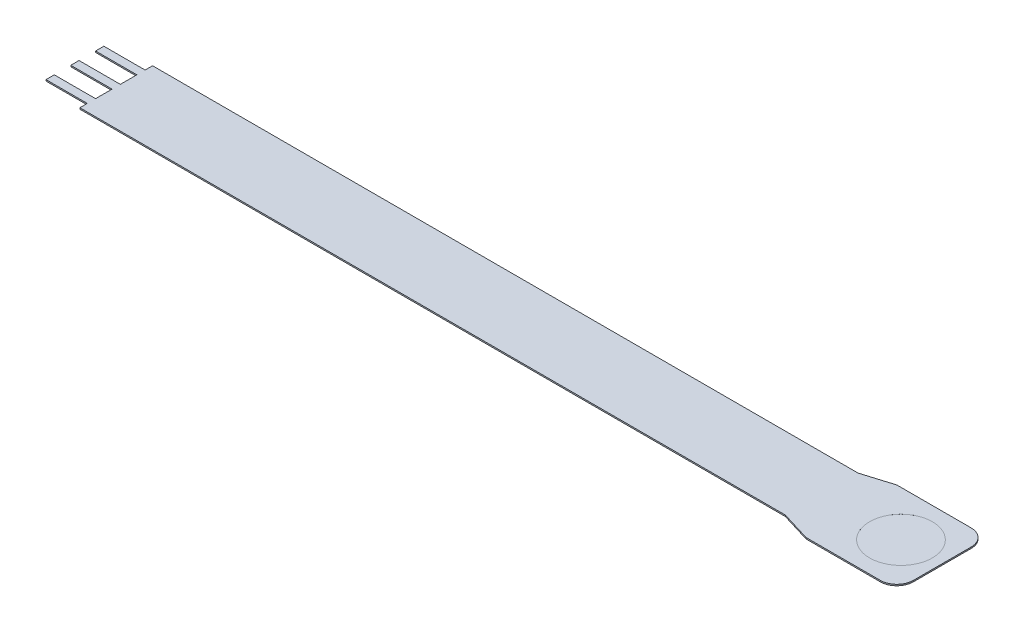
ISO-10303-21;
HEADER;
FILE_DESCRIPTION(('STEP AP214'),'2;1');
FILE_NAME('part.step','',(''),(''),'','','');
FILE_SCHEMA(('AUTOMOTIVE_DESIGN { 1 0 10303 214 1 1 1 1 }'));
ENDSEC;
DATA;
#1=APPLICATION_CONTEXT('core data for automotive mechanical design processes');
#2=APPLICATION_PROTOCOL_DEFINITION('international standard','automotive_design',2000,#1);
#3=PRODUCT_CONTEXT('',#1,'mechanical');
#4=PRODUCT('Part','Part','',(#3));
#5=PRODUCT_RELATED_PRODUCT_CATEGORY('part','',(#4));
#6=PRODUCT_DEFINITION_FORMATION('','',#4);
#7=PRODUCT_DEFINITION_CONTEXT('part definition',#1,'design');
#8=PRODUCT_DEFINITION('design','',#6,#7);
#9=PRODUCT_DEFINITION_SHAPE('','',#8);
#10=(LENGTH_UNIT() NAMED_UNIT(*) SI_UNIT(.MILLI.,.METRE.));
#11=(NAMED_UNIT(*) PLANE_ANGLE_UNIT() SI_UNIT($,.RADIAN.));
#12=(NAMED_UNIT(*) SI_UNIT($,.STERADIAN.) SOLID_ANGLE_UNIT());
#13=UNCERTAINTY_MEASURE_WITH_UNIT(LENGTH_MEASURE(1.E-05),#10,'distance_accuracy_value','');
#14=(GEOMETRIC_REPRESENTATION_CONTEXT(3) GLOBAL_UNCERTAINTY_ASSIGNED_CONTEXT((#13)) GLOBAL_UNIT_ASSIGNED_CONTEXT((#10,
#11,#12)) REPRESENTATION_CONTEXT('',''));
#15=CARTESIAN_POINT('',(0.,0.,0.));
#16=DIRECTION('',(0.,0.,1.));
#17=DIRECTION('',(1.,0.,0.));
#18=AXIS2_PLACEMENT_3D('',#15,#16,#17);
#19=CARTESIAN_POINT('',(-12.1920000000001,0.2032,5.58799999999999));
#20=DIRECTION('',(0.29221853559902,0.,-0.956351571051339));
#21=DIRECTION('',(-0.956351571051339,0.,-0.29221853559902));
#22=AXIS2_PLACEMENT_3D('',#19,#20,#21);
#23=PLANE('',#22);
#24=DIRECTION('',(0.956351571051339,0.,0.29221853559902));
#25=VECTOR('',#24,1.);
#26=CARTESIAN_POINT('',(-12.1920000000001,0.,5.58799999999999));
#27=LINE('',#26,#25);
#28=CARTESIAN_POINT('',(-12.1920000000001,0.,5.58799999999999));
#29=VERTEX_POINT('',#28);
#30=CARTESIAN_POINT('',(-7.62000000000006,0.,6.98499999999999));
#31=VERTEX_POINT('',#30);
#32=EDGE_CURVE('E214',#29,#31,#27,.T.);
#33=ORIENTED_EDGE('',*,*,#32,.T.);
#34=DIRECTION('',(0.,-1.,0.));
#35=VECTOR('',#34,1.);
#36=CARTESIAN_POINT('',(-7.62000000000006,0.2032,6.98499999999999));
#37=LINE('',#36,#35);
#38=CARTESIAN_POINT('',(-7.62000000000006,0.2032,6.98499999999999));
#39=VERTEX_POINT('',#38);
#40=EDGE_CURVE('E197',#39,#31,#37,.T.);
#41=ORIENTED_EDGE('',*,*,#40,.F.);
#42=DIRECTION('',(0.956351571051339,0.,0.29221853559902));
#43=VECTOR('',#42,1.);
#44=CARTESIAN_POINT('',(-12.1920000000001,0.2032,5.58799999999999));
#45=LINE('',#44,#43);
#46=CARTESIAN_POINT('',(-12.1920000000001,0.2032,5.58799999999999));
#47=VERTEX_POINT('',#46);
#48=EDGE_CURVE('E202',#47,#39,#45,.T.);
#49=ORIENTED_EDGE('',*,*,#48,.F.);
#50=DIRECTION('',(0.,-1.,0.));
#51=VECTOR('',#50,1.);
#52=CARTESIAN_POINT('',(-12.1920000000001,0.2032,5.58799999999999));
#53=LINE('',#52,#51);
#54=EDGE_CURVE('E294',#47,#29,#53,.T.);
#55=ORIENTED_EDGE('',*,*,#54,.T.);
#56=EDGE_LOOP('',(#33,#41,#49,#55));
#57=FACE_BOUND('',#56,.T.);
#58=ADVANCED_FACE('F45',(#57),#23,.F.);
#59=CARTESIAN_POINT('',(-7.62000000000006,0.2032,6.98499999999999));
#60=DIRECTION('',(0.,0.,-1.));
#61=DIRECTION('',(-1.,0.,0.));
#62=AXIS2_PLACEMENT_3D('',#59,#60,#61);
#63=PLANE('',#62);
#64=DIRECTION('',(1.,0.,0.));
#65=VECTOR('',#64,1.);
#66=CARTESIAN_POINT('',(-7.62000000000006,0.,6.98499999999999));
#67=LINE('',#66,#65);
#68=CARTESIAN_POINT('',(3.81,0.,6.98500000000001));
#69=VERTEX_POINT('',#68);
#70=EDGE_CURVE('E255',#31,#69,#67,.T.);
#71=ORIENTED_EDGE('',*,*,#70,.T.);
#72=DIRECTION('',(0.,-1.,0.));
#73=VECTOR('',#72,1.);
#74=CARTESIAN_POINT('',(3.81,0.2032,6.98500000000001));
#75=LINE('',#74,#73);
#76=CARTESIAN_POINT('',(3.81,0.2032,6.98500000000001));
#77=VERTEX_POINT('',#76);
#78=EDGE_CURVE('E11',#69,#77,#75,.F.);
#79=ORIENTED_EDGE('',*,*,#78,.T.);
#80=DIRECTION('',(1.,0.,0.));
#81=VECTOR('',#80,1.);
#82=CARTESIAN_POINT('',(-7.62000000000006,0.2032,6.98499999999999));
#83=LINE('',#82,#81);
#84=EDGE_CURVE('E193',#39,#77,#83,.T.);
#85=ORIENTED_EDGE('',*,*,#84,.F.);
#86=ORIENTED_EDGE('',*,*,#40,.T.);
#87=EDGE_LOOP('',(#71,#79,#85,#86));
#88=FACE_BOUND('',#87,.T.);
#89=ADVANCED_FACE('F195',(#88),#63,.F.);
#90=CARTESIAN_POINT('',(6.35,0.2032,-6.98499999999999));
#91=DIRECTION('',(-1.,0.,0.));
#92=DIRECTION('',(0.,0.,1.));
#93=AXIS2_PLACEMENT_3D('',#90,#91,#92);
#94=PLANE('',#93);
#95=DIRECTION('',(0.,0.,-1.));
#96=VECTOR('',#95,1.);
#97=CARTESIAN_POINT('',(6.35,0.,-6.98499999999999));
#98=LINE('',#97,#96);
#99=CARTESIAN_POINT('',(6.35,0.,4.44500000000001));
#100=VERTEX_POINT('',#99);
#101=CARTESIAN_POINT('',(6.35,0.,-4.44499999999999));
#102=VERTEX_POINT('',#101);
#103=EDGE_CURVE('E250',#100,#102,#98,.T.);
#104=ORIENTED_EDGE('',*,*,#103,.T.);
#105=DIRECTION('',(0.,-1.,0.));
#106=VECTOR('',#105,1.);
#107=CARTESIAN_POINT('',(6.35,0.2032,-4.44499999999999));
#108=LINE('',#107,#106);
#109=CARTESIAN_POINT('',(6.35,0.2032,-4.44499999999999));
#110=VERTEX_POINT('',#109);
#111=EDGE_CURVE('E66',#102,#110,#108,.F.);
#112=ORIENTED_EDGE('',*,*,#111,.T.);
#113=DIRECTION('',(0.,0.,-1.));
#114=VECTOR('',#113,1.);
#115=CARTESIAN_POINT('',(6.35,0.2032,-6.98499999999999));
#116=LINE('',#115,#114);
#117=CARTESIAN_POINT('',(6.35,0.2032,4.44500000000001));
#118=VERTEX_POINT('',#117);
#119=EDGE_CURVE('E201',#118,#110,#116,.T.);
#120=ORIENTED_EDGE('',*,*,#119,.F.);
#121=DIRECTION('',(0.,-1.,0.));
#122=VECTOR('',#121,1.);
#123=CARTESIAN_POINT('',(6.35,0.2032,4.44500000000001));
#124=LINE('',#123,#122);
#125=EDGE_CURVE('E229',#118,#100,#124,.T.);
#126=ORIENTED_EDGE('',*,*,#125,.T.);
#127=EDGE_LOOP('',(#104,#112,#120,#126));
#128=FACE_BOUND('',#127,.T.);
#129=ADVANCED_FACE('F253',(#128),#94,.F.);
#130=CARTESIAN_POINT('',(-7.62000000000001,0.2032,-6.98499999999999));
#131=DIRECTION('',(0.,0.,1.));
#132=DIRECTION('',(1.,0.,0.));
#133=AXIS2_PLACEMENT_3D('',#130,#131,#132);
#134=PLANE('',#133);
#135=DIRECTION('',(-1.,0.,0.));
#136=VECTOR('',#135,1.);
#137=CARTESIAN_POINT('',(-7.62000000000001,0.2032,-6.98499999999999));
#138=LINE('',#137,#136);
#139=CARTESIAN_POINT('',(3.81,0.2032,-6.98499999999999));
#140=VERTEX_POINT('',#139);
#141=CARTESIAN_POINT('',(-7.62000000000001,0.2032,-6.98499999999999));
#142=VERTEX_POINT('',#141);
#143=EDGE_CURVE('E236',#140,#142,#138,.T.);
#144=ORIENTED_EDGE('',*,*,#143,.F.);
#145=DIRECTION('',(0.,-1.,0.));
#146=VECTOR('',#145,1.);
#147=CARTESIAN_POINT('',(3.81,0.2032,-6.98499999999999));
#148=LINE('',#147,#146);
#149=CARTESIAN_POINT('',(3.81,0.,-6.98499999999999));
#150=VERTEX_POINT('',#149);
#151=EDGE_CURVE('E215',#140,#150,#148,.T.);
#152=ORIENTED_EDGE('',*,*,#151,.T.);
#153=DIRECTION('',(-1.,0.,0.));
#154=VECTOR('',#153,1.);
#155=CARTESIAN_POINT('',(-7.62000000000001,0.,-6.98499999999999));
#156=LINE('',#155,#154);
#157=CARTESIAN_POINT('',(-7.62000000000001,0.,-6.98499999999999));
#158=VERTEX_POINT('',#157);
#159=EDGE_CURVE('E252',#150,#158,#156,.T.);
#160=ORIENTED_EDGE('',*,*,#159,.T.);
#161=DIRECTION('',(0.,-1.,0.));
#162=VECTOR('',#161,1.);
#163=CARTESIAN_POINT('',(-7.62000000000001,0.2032,-6.98499999999999));
#164=LINE('',#163,#162);
#165=EDGE_CURVE('E216',#142,#158,#164,.T.);
#166=ORIENTED_EDGE('',*,*,#165,.F.);
#167=EDGE_LOOP('',(#144,#152,#160,#166));
#168=FACE_BOUND('',#167,.T.);
#169=ADVANCED_FACE('F241',(#168),#134,.F.);
#170=CARTESIAN_POINT('',(-12.192,0.2032,-5.58799999999999));
#171=DIRECTION('',(0.292218535599021,0.,0.956351571051339));
#172=DIRECTION('',(0.956351571051339,0.,-0.292218535599021));
#173=AXIS2_PLACEMENT_3D('',#170,#171,#172);
#174=PLANE('',#173);
#175=DIRECTION('',(-0.956351571051339,0.,0.292218535599021));
#176=VECTOR('',#175,1.);
#177=CARTESIAN_POINT('',(-12.192,0.,-5.58799999999999));
#178=LINE('',#177,#176);
#179=CARTESIAN_POINT('',(-12.192,0.,-5.58799999999999));
#180=VERTEX_POINT('',#179);
#181=EDGE_CURVE('E257',#158,#180,#178,.T.);
#182=ORIENTED_EDGE('',*,*,#181,.T.);
#183=DIRECTION('',(0.,-1.,0.));
#184=VECTOR('',#183,1.);
#185=CARTESIAN_POINT('',(-12.192,0.2032,-5.58799999999999));
#186=LINE('',#185,#184);
#187=CARTESIAN_POINT('',(-12.192,0.2032,-5.58799999999999));
#188=VERTEX_POINT('',#187);
#189=EDGE_CURVE('E222',#188,#180,#186,.T.);
#190=ORIENTED_EDGE('',*,*,#189,.F.);
#191=DIRECTION('',(-0.956351571051339,0.,0.292218535599021));
#192=VECTOR('',#191,1.);
#193=CARTESIAN_POINT('',(-12.192,0.2032,-5.58799999999999));
#194=LINE('',#193,#192);
#195=EDGE_CURVE('E244',#142,#188,#194,.T.);
#196=ORIENTED_EDGE('',*,*,#195,.F.);
#197=ORIENTED_EDGE('',*,*,#165,.T.);
#198=EDGE_LOOP('',(#182,#190,#196,#197));
#199=FACE_BOUND('',#198,.T.);
#200=ADVANCED_FACE('F345',(#199),#174,.F.);
#201=CARTESIAN_POINT('',(-120.65,0.2032,-5.58799999999999));
#202=DIRECTION('',(0.,0.,1.));
#203=DIRECTION('',(1.,0.,0.));
#204=AXIS2_PLACEMENT_3D('',#201,#202,#203);
#205=PLANE('',#204);
#206=DIRECTION('',(-1.,0.,0.));
#207=VECTOR('',#206,1.);
#208=CARTESIAN_POINT('',(-120.65,0.,-5.58799999999999));
#209=LINE('',#208,#207);
#210=CARTESIAN_POINT('',(-120.65,0.,-5.58799999999999));
#211=VERTEX_POINT('',#210);
#212=EDGE_CURVE('E264',#180,#211,#209,.T.);
#213=ORIENTED_EDGE('',*,*,#212,.T.);
#214=DIRECTION('',(0.,-1.,0.));
#215=VECTOR('',#214,1.);
#216=CARTESIAN_POINT('',(-120.65,0.2032,-5.58799999999999));
#217=LINE('',#216,#215);
#218=CARTESIAN_POINT('',(-120.65,0.2032,-5.58799999999999));
#219=VERTEX_POINT('',#218);
#220=EDGE_CURVE('E335',#219,#211,#217,.T.);
#221=ORIENTED_EDGE('',*,*,#220,.F.);
#222=DIRECTION('',(-1.,0.,0.));
#223=VECTOR('',#222,1.);
#224=CARTESIAN_POINT('',(-108.74870511297,0.2032,-5.58799999999999));
#225=LINE('',#224,#223);
#226=EDGE_CURVE('E343',#188,#219,#225,.T.);
#227=ORIENTED_EDGE('',*,*,#226,.F.);
#228=ORIENTED_EDGE('',*,*,#189,.T.);
#229=EDGE_LOOP('',(#213,#221,#227,#228));
#230=FACE_BOUND('',#229,.T.);
#231=ADVANCED_FACE('F341',(#230),#205,.F.);
#232=CARTESIAN_POINT('',(-120.65,0.2032,-5.58799999999999));
#233=DIRECTION('',(1.,0.,0.));
#234=DIRECTION('',(0.,0.,-1.));
#235=AXIS2_PLACEMENT_3D('',#232,#233,#234);
#236=PLANE('',#235);
#237=DIRECTION('',(0.,0.,1.));
#238=VECTOR('',#237,1.);
#239=CARTESIAN_POINT('',(-120.65,0.,-5.58799999999999));
#240=LINE('',#239,#238);
#241=CARTESIAN_POINT('',(-120.65,0.,-4.44499999999999));
#242=VERTEX_POINT('',#241);
#243=EDGE_CURVE('E266',#211,#242,#240,.T.);
#244=ORIENTED_EDGE('',*,*,#243,.T.);
#245=DIRECTION('',(0.,-1.,0.));
#246=VECTOR('',#245,1.);
#247=CARTESIAN_POINT('',(-120.65,0.2032,-4.44499999999999));
#248=LINE('',#247,#246);
#249=CARTESIAN_POINT('',(-120.65,0.2032,-4.44499999999999));
#250=VERTEX_POINT('',#249);
#251=EDGE_CURVE('E332',#250,#242,#248,.T.);
#252=ORIENTED_EDGE('',*,*,#251,.F.);
#253=DIRECTION('',(0.,0.,1.));
#254=VECTOR('',#253,1.);
#255=CARTESIAN_POINT('',(-120.65,0.2032,-5.58799999999999));
#256=LINE('',#255,#254);
#257=EDGE_CURVE('E360',#219,#250,#256,.T.);
#258=ORIENTED_EDGE('',*,*,#257,.F.);
#259=ORIENTED_EDGE('',*,*,#220,.T.);
#260=EDGE_LOOP('',(#244,#252,#258,#259));
#261=FACE_BOUND('',#260,.T.);
#262=ADVANCED_FACE('F351',(#261),#236,.F.);
#263=CARTESIAN_POINT('',(-120.65,0.2032,-4.44499999999999));
#264=DIRECTION('',(0.,0.,1.));
#265=DIRECTION('',(1.,0.,0.));
#266=AXIS2_PLACEMENT_3D('',#263,#264,#265);
#267=PLANE('',#266);
#268=DIRECTION('',(-1.,0.,0.));
#269=VECTOR('',#268,1.);
#270=CARTESIAN_POINT('',(-120.65,0.,-4.44499999999999));
#271=LINE('',#270,#269);
#272=CARTESIAN_POINT('',(-127.,0.,-4.44499999999999));
#273=VERTEX_POINT('',#272);
#274=EDGE_CURVE('E268',#242,#273,#271,.T.);
#275=ORIENTED_EDGE('',*,*,#274,.T.);
#276=DIRECTION('',(0.,-1.,0.));
#277=VECTOR('',#276,1.);
#278=CARTESIAN_POINT('',(-127.,0.2032,-4.44499999999999));
#279=LINE('',#278,#277);
#280=CARTESIAN_POINT('',(-127.,0.2032,-4.44499999999999));
#281=VERTEX_POINT('',#280);
#282=EDGE_CURVE('E329',#281,#273,#279,.T.);
#283=ORIENTED_EDGE('',*,*,#282,.F.);
#284=DIRECTION('',(-1.,0.,0.));
#285=VECTOR('',#284,1.);
#286=CARTESIAN_POINT('',(-120.65,0.2032,-4.44499999999999));
#287=LINE('',#286,#285);
#288=EDGE_CURVE('E357',#250,#281,#287,.T.);
#289=ORIENTED_EDGE('',*,*,#288,.F.);
#290=ORIENTED_EDGE('',*,*,#251,.T.);
#291=EDGE_LOOP('',(#275,#283,#289,#290));
#292=FACE_BOUND('',#291,.T.);
#293=ADVANCED_FACE('F355',(#292),#267,.F.);
#294=CARTESIAN_POINT('',(-127.,0.2032,-3.17499999999999));
#295=DIRECTION('',(1.,0.,0.));
#296=DIRECTION('',(0.,0.,-1.));
#297=AXIS2_PLACEMENT_3D('',#294,#295,#296);
#298=PLANE('',#297);
#299=DIRECTION('',(0.,0.,1.));
#300=VECTOR('',#299,1.);
#301=CARTESIAN_POINT('',(-127.,0.,-3.17499999999999));
#302=LINE('',#301,#300);
#303=CARTESIAN_POINT('',(-127.,0.,-3.17499999999999));
#304=VERTEX_POINT('',#303);
#305=EDGE_CURVE('E270',#273,#304,#302,.T.);
#306=ORIENTED_EDGE('',*,*,#305,.T.);
#307=DIRECTION('',(0.,-1.,0.));
#308=VECTOR('',#307,1.);
#309=CARTESIAN_POINT('',(-127.,0.2032,-3.17499999999999));
#310=LINE('',#309,#308);
#311=CARTESIAN_POINT('',(-127.,0.2032,-3.17499999999999));
#312=VERTEX_POINT('',#311);
#313=EDGE_CURVE('E326',#312,#304,#310,.T.);
#314=ORIENTED_EDGE('',*,*,#313,.F.);
#315=DIRECTION('',(0.,0.,1.));
#316=VECTOR('',#315,1.);
#317=CARTESIAN_POINT('',(-127.,0.2032,-3.17499999999999));
#318=LINE('',#317,#316);
#319=EDGE_CURVE('E359',#281,#312,#318,.T.);
#320=ORIENTED_EDGE('',*,*,#319,.F.);
#321=ORIENTED_EDGE('',*,*,#282,.T.);
#322=EDGE_LOOP('',(#306,#314,#320,#321));
#323=FACE_BOUND('',#322,.T.);
#324=ADVANCED_FACE('F534',(#323),#298,.F.);
#325=CARTESIAN_POINT('',(-120.65,0.2032,-3.17499999999999));
#326=DIRECTION('',(0.,0.,-1.));
#327=DIRECTION('',(-1.,0.,0.));
#328=AXIS2_PLACEMENT_3D('',#325,#326,#327);
#329=PLANE('',#328);
#330=DIRECTION('',(1.,0.,0.));
#331=VECTOR('',#330,1.);
#332=CARTESIAN_POINT('',(-120.65,0.,-3.17499999999999));
#333=LINE('',#332,#331);
#334=CARTESIAN_POINT('',(-120.65,0.,-3.17499999999999));
#335=VERTEX_POINT('',#334);
#336=EDGE_CURVE('E272',#304,#335,#333,.T.);
#337=ORIENTED_EDGE('',*,*,#336,.T.);
#338=DIRECTION('',(0.,-1.,0.));
#339=VECTOR('',#338,1.);
#340=CARTESIAN_POINT('',(-120.65,0.2032,-3.17499999999999));
#341=LINE('',#340,#339);
#342=CARTESIAN_POINT('',(-120.65,0.2032,-3.17499999999999));
#343=VERTEX_POINT('',#342);
#344=EDGE_CURVE('E323',#343,#335,#341,.T.);
#345=ORIENTED_EDGE('',*,*,#344,.F.);
#346=DIRECTION('',(1.,0.,0.));
#347=VECTOR('',#346,1.);
#348=CARTESIAN_POINT('',(-120.65,0.2032,-3.17499999999999));
#349=LINE('',#348,#347);
#350=EDGE_CURVE('E362',#312,#343,#349,.T.);
#351=ORIENTED_EDGE('',*,*,#350,.F.);
#352=ORIENTED_EDGE('',*,*,#313,.T.);
#353=EDGE_LOOP('',(#337,#345,#351,#352));
#354=FACE_BOUND('',#353,.T.);
#355=ADVANCED_FACE('F524',(#354),#329,.F.);
#356=CARTESIAN_POINT('',(-120.65,0.2032,-3.17499999999999));
#357=DIRECTION('',(1.,0.,0.));
#358=DIRECTION('',(0.,0.,-1.));
#359=AXIS2_PLACEMENT_3D('',#356,#357,#358);
#360=PLANE('',#359);
#361=DIRECTION('',(0.,0.,1.));
#362=VECTOR('',#361,1.);
#363=CARTESIAN_POINT('',(-120.65,0.,-3.17499999999999));
#364=LINE('',#363,#362);
#365=CARTESIAN_POINT('',(-120.65,0.,-0.634999999999987));
#366=VERTEX_POINT('',#365);
#367=EDGE_CURVE('E274',#335,#366,#364,.T.);
#368=ORIENTED_EDGE('',*,*,#367,.T.);
#369=DIRECTION('',(0.,-1.,0.));
#370=VECTOR('',#369,1.);
#371=CARTESIAN_POINT('',(-120.65,0.2032,-0.634999999999987));
#372=LINE('',#371,#370);
#373=CARTESIAN_POINT('',(-120.65,0.2032,-0.634999999999987));
#374=VERTEX_POINT('',#373);
#375=EDGE_CURVE('E320',#374,#366,#372,.T.);
#376=ORIENTED_EDGE('',*,*,#375,.F.);
#377=DIRECTION('',(0.,0.,1.));
#378=VECTOR('',#377,1.);
#379=CARTESIAN_POINT('',(-120.65,0.2032,-3.17499999999999));
#380=LINE('',#379,#378);
#381=EDGE_CURVE('E368',#343,#374,#380,.T.);
#382=ORIENTED_EDGE('',*,*,#381,.F.);
#383=ORIENTED_EDGE('',*,*,#344,.T.);
#384=EDGE_LOOP('',(#368,#376,#382,#383));
#385=FACE_BOUND('',#384,.T.);
#386=ADVANCED_FACE('F514',(#385),#360,.F.);
#387=CARTESIAN_POINT('',(-120.65,0.2032,-0.634999999999987));
#388=DIRECTION('',(0.,0.,1.));
#389=DIRECTION('',(1.,0.,0.));
#390=AXIS2_PLACEMENT_3D('',#387,#388,#389);
#391=PLANE('',#390);
#392=DIRECTION('',(-1.,0.,0.));
#393=VECTOR('',#392,1.);
#394=CARTESIAN_POINT('',(-120.65,0.,-0.634999999999987));
#395=LINE('',#394,#393);
#396=CARTESIAN_POINT('',(-127.,0.,-0.634999999999988));
#397=VERTEX_POINT('',#396);
#398=EDGE_CURVE('E276',#366,#397,#395,.T.);
#399=ORIENTED_EDGE('',*,*,#398,.T.);
#400=DIRECTION('',(0.,-1.,0.));
#401=VECTOR('',#400,1.);
#402=CARTESIAN_POINT('',(-127.,0.2032,-0.634999999999988));
#403=LINE('',#402,#401);
#404=CARTESIAN_POINT('',(-127.,0.2032,-0.634999999999988));
#405=VERTEX_POINT('',#404);
#406=EDGE_CURVE('E317',#405,#397,#403,.T.);
#407=ORIENTED_EDGE('',*,*,#406,.F.);
#408=DIRECTION('',(-1.,0.,0.));
#409=VECTOR('',#408,1.);
#410=CARTESIAN_POINT('',(-120.65,0.2032,-0.634999999999987));
#411=LINE('',#410,#409);
#412=EDGE_CURVE('E370',#374,#405,#411,.T.);
#413=ORIENTED_EDGE('',*,*,#412,.F.);
#414=ORIENTED_EDGE('',*,*,#375,.T.);
#415=EDGE_LOOP('',(#399,#407,#413,#414));
#416=FACE_BOUND('',#415,.T.);
#417=ADVANCED_FACE('F504',(#416),#391,.F.);
#418=CARTESIAN_POINT('',(-127.,0.2032,0.635000000000013));
#419=DIRECTION('',(1.,0.,0.));
#420=DIRECTION('',(0.,0.,-1.));
#421=AXIS2_PLACEMENT_3D('',#418,#419,#420);
#422=PLANE('',#421);
#423=DIRECTION('',(0.,0.,1.));
#424=VECTOR('',#423,1.);
#425=CARTESIAN_POINT('',(-127.,0.,0.635000000000013));
#426=LINE('',#425,#424);
#427=CARTESIAN_POINT('',(-127.,0.,0.635000000000013));
#428=VERTEX_POINT('',#427);
#429=EDGE_CURVE('E278',#397,#428,#426,.T.);
#430=ORIENTED_EDGE('',*,*,#429,.T.);
#431=DIRECTION('',(0.,-1.,0.));
#432=VECTOR('',#431,1.);
#433=CARTESIAN_POINT('',(-127.,0.2032,0.635000000000013));
#434=LINE('',#433,#432);
#435=CARTESIAN_POINT('',(-127.,0.2032,0.635000000000013));
#436=VERTEX_POINT('',#435);
#437=EDGE_CURVE('E314',#436,#428,#434,.T.);
#438=ORIENTED_EDGE('',*,*,#437,.F.);
#439=DIRECTION('',(0.,0.,1.));
#440=VECTOR('',#439,1.);
#441=CARTESIAN_POINT('',(-127.,0.2032,0.635000000000013));
#442=LINE('',#441,#440);
#443=EDGE_CURVE('E372',#405,#436,#442,.T.);
#444=ORIENTED_EDGE('',*,*,#443,.F.);
#445=ORIENTED_EDGE('',*,*,#406,.T.);
#446=EDGE_LOOP('',(#430,#438,#444,#445));
#447=FACE_BOUND('',#446,.T.);
#448=ADVANCED_FACE('F494',(#447),#422,.F.);
#449=CARTESIAN_POINT('',(-120.65,0.2032,0.635000000000012));
#450=DIRECTION('',(0.,0.,-1.));
#451=DIRECTION('',(-1.,0.,0.));
#452=AXIS2_PLACEMENT_3D('',#449,#450,#451);
#453=PLANE('',#452);
#454=DIRECTION('',(1.,0.,0.));
#455=VECTOR('',#454,1.);
#456=CARTESIAN_POINT('',(-120.65,0.,0.635000000000012));
#457=LINE('',#456,#455);
#458=CARTESIAN_POINT('',(-120.65,0.,0.635000000000012));
#459=VERTEX_POINT('',#458);
#460=EDGE_CURVE('E280',#428,#459,#457,.T.);
#461=ORIENTED_EDGE('',*,*,#460,.T.);
#462=DIRECTION('',(0.,-1.,0.));
#463=VECTOR('',#462,1.);
#464=CARTESIAN_POINT('',(-120.65,0.2032,0.635000000000012));
#465=LINE('',#464,#463);
#466=CARTESIAN_POINT('',(-120.65,0.2032,0.635000000000012));
#467=VERTEX_POINT('',#466);
#468=EDGE_CURVE('E311',#467,#459,#465,.T.);
#469=ORIENTED_EDGE('',*,*,#468,.F.);
#470=DIRECTION('',(1.,0.,0.));
#471=VECTOR('',#470,1.);
#472=CARTESIAN_POINT('',(-120.65,0.2032,0.635000000000012));
#473=LINE('',#472,#471);
#474=EDGE_CURVE('E374',#436,#467,#473,.T.);
#475=ORIENTED_EDGE('',*,*,#474,.F.);
#476=ORIENTED_EDGE('',*,*,#437,.T.);
#477=EDGE_LOOP('',(#461,#469,#475,#476));
#478=FACE_BOUND('',#477,.T.);
#479=ADVANCED_FACE('F484',(#478),#453,.F.);
#480=CARTESIAN_POINT('',(-120.65,0.2032,0.635000000000012));
#481=DIRECTION('',(1.,0.,0.));
#482=DIRECTION('',(0.,0.,-1.));
#483=AXIS2_PLACEMENT_3D('',#480,#481,#482);
#484=PLANE('',#483);
#485=DIRECTION('',(0.,0.,1.));
#486=VECTOR('',#485,1.);
#487=CARTESIAN_POINT('',(-120.65,0.,0.635000000000012));
#488=LINE('',#487,#486);
#489=CARTESIAN_POINT('',(-120.65,0.,3.17500000000001));
#490=VERTEX_POINT('',#489);
#491=EDGE_CURVE('E282',#459,#490,#488,.T.);
#492=ORIENTED_EDGE('',*,*,#491,.T.);
#493=DIRECTION('',(0.,-1.,0.));
#494=VECTOR('',#493,1.);
#495=CARTESIAN_POINT('',(-120.65,0.2032,3.17500000000001));
#496=LINE('',#495,#494);
#497=CARTESIAN_POINT('',(-120.65,0.2032,3.17500000000001));
#498=VERTEX_POINT('',#497);
#499=EDGE_CURVE('E308',#498,#490,#496,.T.);
#500=ORIENTED_EDGE('',*,*,#499,.F.);
#501=DIRECTION('',(0.,0.,1.));
#502=VECTOR('',#501,1.);
#503=CARTESIAN_POINT('',(-120.65,0.2032,0.635000000000012));
#504=LINE('',#503,#502);
#505=EDGE_CURVE('E376',#467,#498,#504,.T.);
#506=ORIENTED_EDGE('',*,*,#505,.F.);
#507=ORIENTED_EDGE('',*,*,#468,.T.);
#508=EDGE_LOOP('',(#492,#500,#506,#507));
#509=FACE_BOUND('',#508,.T.);
#510=ADVANCED_FACE('F474',(#509),#484,.F.);
#511=CARTESIAN_POINT('',(-120.65,0.2032,3.17500000000001));
#512=DIRECTION('',(0.,0.,1.));
#513=DIRECTION('',(1.,0.,0.));
#514=AXIS2_PLACEMENT_3D('',#511,#512,#513);
#515=PLANE('',#514);
#516=DIRECTION('',(-1.,0.,0.));
#517=VECTOR('',#516,1.);
#518=CARTESIAN_POINT('',(-120.65,0.,3.17500000000001));
#519=LINE('',#518,#517);
#520=CARTESIAN_POINT('',(-127.,0.,3.17500000000001));
#521=VERTEX_POINT('',#520);
#522=EDGE_CURVE('E284',#490,#521,#519,.T.);
#523=ORIENTED_EDGE('',*,*,#522,.T.);
#524=DIRECTION('',(0.,-1.,0.));
#525=VECTOR('',#524,1.);
#526=CARTESIAN_POINT('',(-127.,0.2032,3.17500000000001));
#527=LINE('',#526,#525);
#528=CARTESIAN_POINT('',(-127.,0.2032,3.17500000000001));
#529=VERTEX_POINT('',#528);
#530=EDGE_CURVE('E305',#529,#521,#527,.T.);
#531=ORIENTED_EDGE('',*,*,#530,.F.);
#532=DIRECTION('',(-1.,0.,0.));
#533=VECTOR('',#532,1.);
#534=CARTESIAN_POINT('',(-120.65,0.2032,3.17500000000001));
#535=LINE('',#534,#533);
#536=EDGE_CURVE('E378',#498,#529,#535,.T.);
#537=ORIENTED_EDGE('',*,*,#536,.F.);
#538=ORIENTED_EDGE('',*,*,#499,.T.);
#539=EDGE_LOOP('',(#523,#531,#537,#538));
#540=FACE_BOUND('',#539,.T.);
#541=ADVANCED_FACE('F464',(#540),#515,.F.);
#542=CARTESIAN_POINT('',(-127.,0.2032,3.17500000000001));
#543=DIRECTION('',(1.,0.,0.));
#544=DIRECTION('',(0.,0.,-1.));
#545=AXIS2_PLACEMENT_3D('',#542,#543,#544);
#546=PLANE('',#545);
#547=DIRECTION('',(0.,0.,1.));
#548=VECTOR('',#547,1.);
#549=CARTESIAN_POINT('',(-127.,0.,3.17500000000001));
#550=LINE('',#549,#548);
#551=CARTESIAN_POINT('',(-127.,0.,4.44500000000001));
#552=VERTEX_POINT('',#551);
#553=EDGE_CURVE('E286',#521,#552,#550,.T.);
#554=ORIENTED_EDGE('',*,*,#553,.T.);
#555=DIRECTION('',(0.,-1.,0.));
#556=VECTOR('',#555,1.);
#557=CARTESIAN_POINT('',(-127.,0.2032,4.44500000000001));
#558=LINE('',#557,#556);
#559=CARTESIAN_POINT('',(-127.,0.2032,4.44500000000001));
#560=VERTEX_POINT('',#559);
#561=EDGE_CURVE('E302',#560,#552,#558,.T.);
#562=ORIENTED_EDGE('',*,*,#561,.F.);
#563=DIRECTION('',(0.,0.,1.));
#564=VECTOR('',#563,1.);
#565=CARTESIAN_POINT('',(-127.,0.2032,3.17500000000001));
#566=LINE('',#565,#564);
#567=EDGE_CURVE('E380',#529,#560,#566,.T.);
#568=ORIENTED_EDGE('',*,*,#567,.F.);
#569=ORIENTED_EDGE('',*,*,#530,.T.);
#570=EDGE_LOOP('',(#554,#562,#568,#569));
#571=FACE_BOUND('',#570,.T.);
#572=ADVANCED_FACE('F454',(#571),#546,.F.);
#573=CARTESIAN_POINT('',(-120.65,0.2032,4.44500000000001));
#574=DIRECTION('',(0.,0.,-1.));
#575=DIRECTION('',(-1.,0.,0.));
#576=AXIS2_PLACEMENT_3D('',#573,#574,#575);
#577=PLANE('',#576);
#578=DIRECTION('',(1.,0.,0.));
#579=VECTOR('',#578,1.);
#580=CARTESIAN_POINT('',(-120.65,0.,4.44500000000001));
#581=LINE('',#580,#579);
#582=CARTESIAN_POINT('',(-120.65,0.,4.44500000000001));
#583=VERTEX_POINT('',#582);
#584=EDGE_CURVE('E288',#552,#583,#581,.T.);
#585=ORIENTED_EDGE('',*,*,#584,.T.);
#586=DIRECTION('',(0.,-1.,0.));
#587=VECTOR('',#586,1.);
#588=CARTESIAN_POINT('',(-120.65,0.2032,4.44500000000001));
#589=LINE('',#588,#587);
#590=CARTESIAN_POINT('',(-120.65,0.2032,4.44500000000001));
#591=VERTEX_POINT('',#590);
#592=EDGE_CURVE('E299',#591,#583,#589,.T.);
#593=ORIENTED_EDGE('',*,*,#592,.F.);
#594=DIRECTION('',(1.,0.,0.));
#595=VECTOR('',#594,1.);
#596=CARTESIAN_POINT('',(-120.65,0.2032,4.44500000000001));
#597=LINE('',#596,#595);
#598=EDGE_CURVE('E382',#560,#591,#597,.T.);
#599=ORIENTED_EDGE('',*,*,#598,.F.);
#600=ORIENTED_EDGE('',*,*,#561,.T.);
#601=EDGE_LOOP('',(#585,#593,#599,#600));
#602=FACE_BOUND('',#601,.T.);
#603=ADVANCED_FACE('F450',(#602),#577,.F.);
#604=CARTESIAN_POINT('',(-120.65,0.2032,5.58800000000002));
#605=DIRECTION('',(1.,0.,0.));
#606=DIRECTION('',(0.,0.,-1.));
#607=AXIS2_PLACEMENT_3D('',#604,#605,#606);
#608=PLANE('',#607);
#609=DIRECTION('',(0.,0.,1.));
#610=VECTOR('',#609,1.);
#611=CARTESIAN_POINT('',(-120.65,0.,5.58800000000002));
#612=LINE('',#611,#610);
#613=CARTESIAN_POINT('',(-120.65,0.,5.58800000000002));
#614=VERTEX_POINT('',#613);
#615=EDGE_CURVE('E290',#583,#614,#612,.T.);
#616=ORIENTED_EDGE('',*,*,#615,.T.);
#617=DIRECTION('',(0.,-1.,0.));
#618=VECTOR('',#617,1.);
#619=CARTESIAN_POINT('',(-120.65,0.2032,5.58800000000002));
#620=LINE('',#619,#618);
#621=CARTESIAN_POINT('',(-120.65,0.2032,5.58800000000002));
#622=VERTEX_POINT('',#621);
#623=EDGE_CURVE('E296',#622,#614,#620,.T.);
#624=ORIENTED_EDGE('',*,*,#623,.F.);
#625=DIRECTION('',(0.,0.,1.));
#626=VECTOR('',#625,1.);
#627=CARTESIAN_POINT('',(-120.65,0.2032,5.58800000000002));
#628=LINE('',#627,#626);
#629=EDGE_CURVE('E384',#591,#622,#628,.T.);
#630=ORIENTED_EDGE('',*,*,#629,.F.);
#631=ORIENTED_EDGE('',*,*,#592,.T.);
#632=EDGE_LOOP('',(#616,#624,#630,#631));
#633=FACE_BOUND('',#632,.T.);
#634=ADVANCED_FACE('F409',(#633),#608,.F.);
#635=CARTESIAN_POINT('',(-108.74870511297,0.2032,5.58800000000001));
#636=DIRECTION('',(0.,0.,-1.));
#637=DIRECTION('',(-1.,0.,0.));
#638=AXIS2_PLACEMENT_3D('',#635,#636,#637);
#639=PLANE('',#638);
#640=DIRECTION('',(1.,0.,0.));
#641=VECTOR('',#640,1.);
#642=CARTESIAN_POINT('',(-108.74870511297,0.,5.58800000000001));
#643=LINE('',#642,#641);
#644=EDGE_CURVE('E211',#614,#29,#643,.T.);
#645=ORIENTED_EDGE('',*,*,#644,.T.);
#646=ORIENTED_EDGE('',*,*,#54,.F.);
#647=DIRECTION('',(1.,0.,0.));
#648=VECTOR('',#647,1.);
#649=CARTESIAN_POINT('',(-120.65,0.2032,5.58800000000002));
#650=LINE('',#649,#648);
#651=EDGE_CURVE('E207',#622,#47,#650,.T.);
#652=ORIENTED_EDGE('',*,*,#651,.F.);
#653=ORIENTED_EDGE('',*,*,#623,.T.);
#654=EDGE_LOOP('',(#645,#646,#652,#653));
#655=FACE_BOUND('',#654,.T.);
#656=ADVANCED_FACE('F401',(#655),#639,.F.);
#657=CARTESIAN_POINT('',(0.,0.2032,0.));
#658=DIRECTION('',(0.,-1.,0.));
#659=DIRECTION('',(0.,0.,-1.));
#660=AXIS2_PLACEMENT_3D('',#657,#658,#659);
#661=PLANE('',#660);
#662=CARTESIAN_POINT('',(0.,0.2032,0.));
#663=DIRECTION('',(0.,1.,0.));
#664=DIRECTION('',(0.,0.,1.));
#665=AXIS2_PLACEMENT_3D('',#662,#663,#664);
#666=CIRCLE('',#665,4.826);
#667=CARTESIAN_POINT('',(0.,0.2032,4.826));
#668=VERTEX_POINT('',#667);
#669=EDGE_CURVE('E388',#668,#668,#666,.T.);
#670=ORIENTED_EDGE('',*,*,#669,.F.);
#671=EDGE_LOOP('',(#670));
#672=FACE_BOUND('',#671,.T.);
#673=ORIENTED_EDGE('',*,*,#119,.T.);
#674=CARTESIAN_POINT('',(3.81,0.2032,-4.44499999999999));
#675=DIRECTION('',(0.,-1.,0.));
#676=DIRECTION('',(0.,0.,-1.));
#677=AXIS2_PLACEMENT_3D('',#674,#675,#676);
#678=CIRCLE('',#677,2.54);
#679=EDGE_CURVE('E53',#110,#140,#678,.F.);
#680=ORIENTED_EDGE('',*,*,#679,.T.);
#681=ORIENTED_EDGE('',*,*,#143,.T.);
#682=ORIENTED_EDGE('',*,*,#195,.T.);
#683=ORIENTED_EDGE('',*,*,#226,.T.);
#684=ORIENTED_EDGE('',*,*,#257,.T.);
#685=ORIENTED_EDGE('',*,*,#288,.T.);
#686=ORIENTED_EDGE('',*,*,#319,.T.);
#687=ORIENTED_EDGE('',*,*,#350,.T.);
#688=ORIENTED_EDGE('',*,*,#381,.T.);
#689=ORIENTED_EDGE('',*,*,#412,.T.);
#690=ORIENTED_EDGE('',*,*,#443,.T.);
#691=ORIENTED_EDGE('',*,*,#474,.T.);
#692=ORIENTED_EDGE('',*,*,#505,.T.);
#693=ORIENTED_EDGE('',*,*,#536,.T.);
#694=ORIENTED_EDGE('',*,*,#567,.T.);
#695=ORIENTED_EDGE('',*,*,#598,.T.);
#696=ORIENTED_EDGE('',*,*,#629,.T.);
#697=ORIENTED_EDGE('',*,*,#651,.T.);
#698=ORIENTED_EDGE('',*,*,#48,.T.);
#699=ORIENTED_EDGE('',*,*,#84,.T.);
#700=CARTESIAN_POINT('',(3.81,0.2032,4.44500000000001));
#701=DIRECTION('',(0.,-1.,0.));
#702=DIRECTION('',(0.,0.,-1.));
#703=AXIS2_PLACEMENT_3D('',#700,#701,#702);
#704=CIRCLE('',#703,2.54);
#705=EDGE_CURVE('E233',#77,#118,#704,.F.);
#706=ORIENTED_EDGE('',*,*,#705,.T.);
#707=EDGE_LOOP('',(#673,#680,#681,#682,#683,#684,#685,#686,#687,#688,#689,#690,#691,#692,#693,
#694,#695,#696,#697,#698,#699,#706));
#708=FACE_BOUND('',#707,.T.);
#709=ADVANCED_FACE('F205',(#672,#708),#661,.F.);
#710=CARTESIAN_POINT('',(0.,0.,0.));
#711=DIRECTION('',(0.,-1.,0.));
#712=DIRECTION('',(0.,0.,-1.));
#713=AXIS2_PLACEMENT_3D('',#710,#711,#712);
#714=PLANE('',#713);
#715=ORIENTED_EDGE('',*,*,#159,.F.);
#716=CARTESIAN_POINT('',(3.81,0.,-4.44499999999999));
#717=DIRECTION('',(0.,-1.,0.));
#718=DIRECTION('',(0.,0.,-1.));
#719=AXIS2_PLACEMENT_3D('',#716,#717,#718);
#720=CIRCLE('',#719,2.54);
#721=EDGE_CURVE('E227',#150,#102,#720,.T.);
#722=ORIENTED_EDGE('',*,*,#721,.T.);
#723=ORIENTED_EDGE('',*,*,#103,.F.);
#724=CARTESIAN_POINT('',(3.81,0.,4.44500000000001));
#725=DIRECTION('',(0.,-1.,0.));
#726=DIRECTION('',(0.,0.,-1.));
#727=AXIS2_PLACEMENT_3D('',#724,#725,#726);
#728=CIRCLE('',#727,2.54);
#729=EDGE_CURVE('E219',#100,#69,#728,.T.);
#730=ORIENTED_EDGE('',*,*,#729,.T.);
#731=ORIENTED_EDGE('',*,*,#70,.F.);
#732=ORIENTED_EDGE('',*,*,#32,.F.);
#733=ORIENTED_EDGE('',*,*,#644,.F.);
#734=ORIENTED_EDGE('',*,*,#615,.F.);
#735=ORIENTED_EDGE('',*,*,#584,.F.);
#736=ORIENTED_EDGE('',*,*,#553,.F.);
#737=ORIENTED_EDGE('',*,*,#522,.F.);
#738=ORIENTED_EDGE('',*,*,#491,.F.);
#739=ORIENTED_EDGE('',*,*,#460,.F.);
#740=ORIENTED_EDGE('',*,*,#429,.F.);
#741=ORIENTED_EDGE('',*,*,#398,.F.);
#742=ORIENTED_EDGE('',*,*,#367,.F.);
#743=ORIENTED_EDGE('',*,*,#336,.F.);
#744=ORIENTED_EDGE('',*,*,#305,.F.);
#745=ORIENTED_EDGE('',*,*,#274,.F.);
#746=ORIENTED_EDGE('',*,*,#243,.F.);
#747=ORIENTED_EDGE('',*,*,#212,.F.);
#748=ORIENTED_EDGE('',*,*,#181,.F.);
#749=EDGE_LOOP('',(#715,#722,#723,#730,#731,#732,#733,#734,#735,#736,#737,#738,#739,#740,#741,
#742,#743,#744,#745,#746,#747,#748));
#750=FACE_BOUND('',#749,.T.);
#751=ADVANCED_FACE('F249',(#750),#714,.T.);
#752=CARTESIAN_POINT('',(0.,0.20066,0.));
#753=DIRECTION('',(0.,1.,0.));
#754=DIRECTION('',(0.,0.,1.));
#755=AXIS2_PLACEMENT_3D('',#752,#753,#754);
#756=CYLINDRICAL_SURFACE('',#755,4.826);
#757=CARTESIAN_POINT('',(0.,0.20066,0.));
#758=DIRECTION('',(0.,1.,0.));
#759=DIRECTION('',(0.,0.,1.));
#760=AXIS2_PLACEMENT_3D('',#757,#758,#759);
#761=CIRCLE('',#760,4.826);
#762=CARTESIAN_POINT('',(0.,0.20066,4.826));
#763=VERTEX_POINT('',#762);
#764=EDGE_CURVE('E386',#763,#763,#761,.T.);
#765=ORIENTED_EDGE('',*,*,#764,.F.);
#766=EDGE_LOOP('',(#765));
#767=FACE_BOUND('',#766,.T.);
#768=ORIENTED_EDGE('',*,*,#669,.T.);
#769=EDGE_LOOP('',(#768));
#770=FACE_BOUND('',#769,.T.);
#771=ADVANCED_FACE('F398',(#767,#770),#756,.F.);
#772=CARTESIAN_POINT('',(0.,0.20066,0.));
#773=DIRECTION('',(0.,1.,0.));
#774=DIRECTION('',(0.,0.,1.));
#775=AXIS2_PLACEMENT_3D('',#772,#773,#774);
#776=PLANE('',#775);
#777=ORIENTED_EDGE('',*,*,#764,.T.);
#778=EDGE_LOOP('',(#777));
#779=FACE_BOUND('',#778,.T.);
#780=ADVANCED_FACE('F422',(#779),#776,.T.);
#781=CARTESIAN_POINT('',(3.81,0.2032,-4.44499999999999));
#782=DIRECTION('',(0.,-1.,0.));
#783=DIRECTION('',(0.,0.,-1.));
#784=AXIS2_PLACEMENT_3D('',#781,#782,#783);
#785=CYLINDRICAL_SURFACE('',#784,2.54);
#786=ORIENTED_EDGE('',*,*,#679,.F.);
#787=ORIENTED_EDGE('',*,*,#111,.F.);
#788=ORIENTED_EDGE('',*,*,#721,.F.);
#789=ORIENTED_EDGE('',*,*,#151,.F.);
#790=EDGE_LOOP('',(#786,#787,#788,#789));
#791=FACE_BOUND('',#790,.T.);
#792=ADVANCED_FACE('F246',(#791),#785,.T.);
#793=CARTESIAN_POINT('',(3.81,0.2032,4.44500000000001));
#794=DIRECTION('',(0.,-1.,0.));
#795=DIRECTION('',(0.,0.,-1.));
#796=AXIS2_PLACEMENT_3D('',#793,#794,#795);
#797=CYLINDRICAL_SURFACE('',#796,2.54);
#798=ORIENTED_EDGE('',*,*,#705,.F.);
#799=ORIENTED_EDGE('',*,*,#78,.F.);
#800=ORIENTED_EDGE('',*,*,#729,.F.);
#801=ORIENTED_EDGE('',*,*,#125,.F.);
#802=EDGE_LOOP('',(#798,#799,#800,#801));
#803=FACE_BOUND('',#802,.T.);
#804=ADVANCED_FACE('F47',(#803),#797,.T.);
#805=CLOSED_SHELL('',(#58,#89,#129,#169,#200,#231,#262,#293,#324,#355,#386,#417,#448,#479,#510,
#541,#572,#603,#634,#656,#709,#751,#771,#780,#792,#804));
#806=MANIFOLD_SOLID_BREP('B2',#805);
#807=ADVANCED_BREP_SHAPE_REPRESENTATION('',(#18,#806),#14);
#808=SHAPE_DEFINITION_REPRESENTATION(#9,#807);
ENDSEC;
END-ISO-10303-21;
